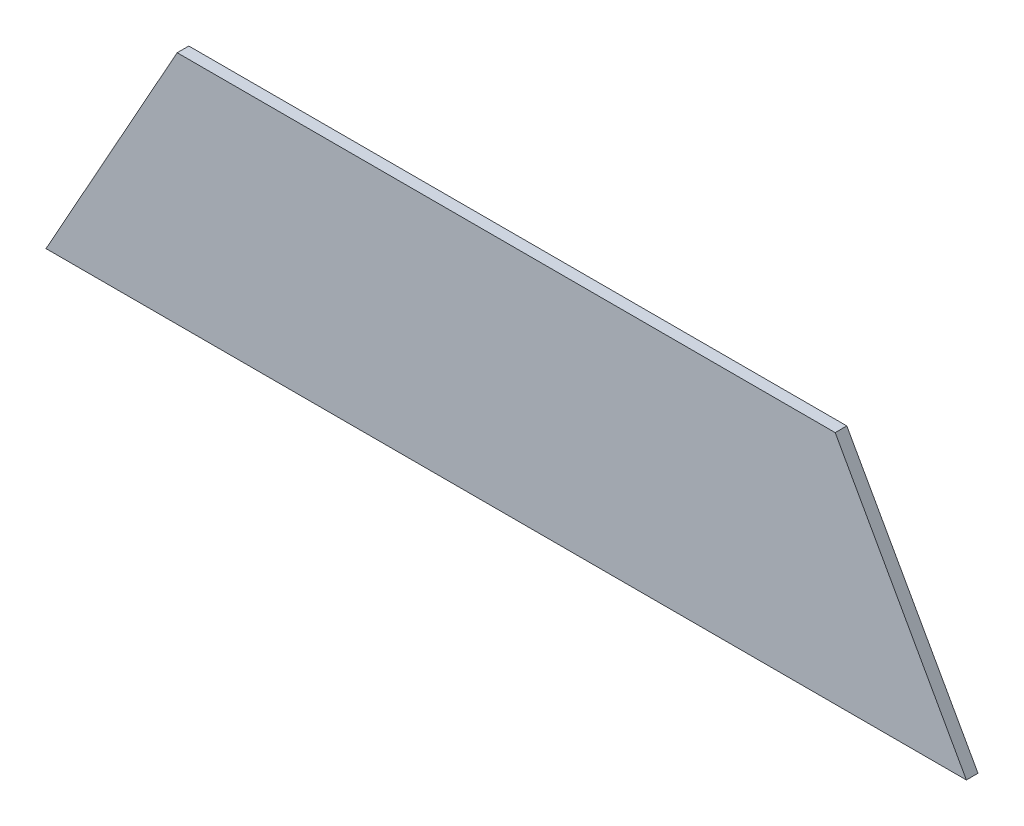
ISO-10303-21;
HEADER;
FILE_DESCRIPTION(('STEP AP214'),'2;1');
FILE_NAME('part.step','',(''),(''),'','','');
FILE_SCHEMA(('AUTOMOTIVE_DESIGN { 1 0 10303 214 1 1 1 1 }'));
ENDSEC;
DATA;
#1=APPLICATION_CONTEXT('core data for automotive mechanical design processes');
#2=APPLICATION_PROTOCOL_DEFINITION('international standard','automotive_design',2000,#1);
#3=PRODUCT_CONTEXT('',#1,'mechanical');
#4=PRODUCT('Part','Part','',(#3));
#5=PRODUCT_RELATED_PRODUCT_CATEGORY('part','',(#4));
#6=PRODUCT_DEFINITION_FORMATION('','',#4);
#7=PRODUCT_DEFINITION_CONTEXT('part definition',#1,'design');
#8=PRODUCT_DEFINITION('design','',#6,#7);
#9=PRODUCT_DEFINITION_SHAPE('','',#8);
#10=(LENGTH_UNIT() NAMED_UNIT(*) SI_UNIT(.MILLI.,.METRE.));
#11=(NAMED_UNIT(*) PLANE_ANGLE_UNIT() SI_UNIT($,.RADIAN.));
#12=(NAMED_UNIT(*) SI_UNIT($,.STERADIAN.) SOLID_ANGLE_UNIT());
#13=UNCERTAINTY_MEASURE_WITH_UNIT(LENGTH_MEASURE(1.E-05),#10,'distance_accuracy_value','');
#14=(GEOMETRIC_REPRESENTATION_CONTEXT(3) GLOBAL_UNCERTAINTY_ASSIGNED_CONTEXT((#13)) GLOBAL_UNIT_ASSIGNED_CONTEXT((#10,
#11,#12)) REPRESENTATION_CONTEXT('',''));
#15=CARTESIAN_POINT('',(0.,0.,0.));
#16=DIRECTION('',(0.,0.,1.));
#17=DIRECTION('',(1.,0.,0.));
#18=AXIS2_PLACEMENT_3D('',#15,#16,#17);
#19=CARTESIAN_POINT('',(0.,-1.38777878078145E-13,-11.9062500000003));
#20=DIRECTION('',(0.,0.,-1.));
#21=DIRECTION('',(0.,1.,0.));
#22=AXIS2_PLACEMENT_3D('',#19,#20,#21);
#23=PLANE('',#22);
#24=DIRECTION('',(1.,0.,0.));
#25=VECTOR('',#24,1.);
#26=CARTESIAN_POINT('',(471.55027255906,-687.093002220171,-11.9062500000005));
#27=LINE('',#26,#25);
#28=CARTESIAN_POINT('',(-471.55027255906,-687.093002220171,-11.9062500000005));
#29=VERTEX_POINT('',#28);
#30=CARTESIAN_POINT('',(471.55027255906,-687.093002220171,-11.9062500000005));
#31=VERTEX_POINT('',#30);
#32=EDGE_CURVE('E36',#29,#31,#27,.T.);
#33=ORIENTED_EDGE('',*,*,#32,.F.);
#34=DIRECTION('',(-0.487058473848149,-0.873369362327711,0.));
#35=VECTOR('',#34,1.);
#36=CARTESIAN_POINT('',(-471.55027255906,-687.093002220171,-11.9062500000005));
#37=LINE('',#36,#35);
#38=CARTESIAN_POINT('',(-337.114930678369,-446.030141974663,-11.9062500000005));
#39=VERTEX_POINT('',#38);
#40=EDGE_CURVE('E60',#39,#29,#37,.T.);
#41=ORIENTED_EDGE('',*,*,#40,.F.);
#42=DIRECTION('',(-1.,0.,0.));
#43=VECTOR('',#42,1.);
#44=CARTESIAN_POINT('',(-337.114930678369,-446.030141974663,-11.9062500000005));
#45=LINE('',#44,#43);
#46=CARTESIAN_POINT('',(337.114930678369,-446.030141974663,-11.9062500000006));
#47=VERTEX_POINT('',#46);
#48=EDGE_CURVE('E80',#47,#39,#45,.T.);
#49=ORIENTED_EDGE('',*,*,#48,.F.);
#50=DIRECTION('',(-0.487058473848149,0.873369362327711,0.));
#51=VECTOR('',#50,1.);
#52=CARTESIAN_POINT('',(337.114930678369,-446.030141974663,-11.9062500000005));
#53=LINE('',#52,#51);
#54=EDGE_CURVE('E65',#31,#47,#53,.T.);
#55=ORIENTED_EDGE('',*,*,#54,.F.);
#56=EDGE_LOOP('',(#33,#41,#49,#55));
#57=FACE_BOUND('',#56,.T.);
#58=ADVANCED_FACE('F28',(#57),#23,.T.);
#59=CARTESIAN_POINT('',(0.,0.,0.));
#60=DIRECTION('',(0.,0.,-1.));
#61=DIRECTION('',(-1.,0.,0.));
#62=AXIS2_PLACEMENT_3D('',#59,#60,#61);
#63=PLANE('',#62);
#64=DIRECTION('',(1.,0.,0.));
#65=VECTOR('',#64,1.);
#66=CARTESIAN_POINT('',(471.55027255906,-687.093002220171,0.));
#67=LINE('',#66,#65);
#68=CARTESIAN_POINT('',(-471.55027255906,-687.093002220171,0.));
#69=VERTEX_POINT('',#68);
#70=CARTESIAN_POINT('',(471.55027255906,-687.093002220171,0.));
#71=VERTEX_POINT('',#70);
#72=EDGE_CURVE('E70',#69,#71,#67,.T.);
#73=ORIENTED_EDGE('',*,*,#72,.T.);
#74=DIRECTION('',(-0.487058473848149,0.873369362327711,0.));
#75=VECTOR('',#74,1.);
#76=CARTESIAN_POINT('',(337.114930678369,-446.030141974663,0.));
#77=LINE('',#76,#75);
#78=CARTESIAN_POINT('',(337.114930678369,-446.030141974663,0.));
#79=VERTEX_POINT('',#78);
#80=EDGE_CURVE('E94',#71,#79,#77,.T.);
#81=ORIENTED_EDGE('',*,*,#80,.T.);
#82=DIRECTION('',(-1.,0.,0.));
#83=VECTOR('',#82,1.);
#84=CARTESIAN_POINT('',(-337.114930678369,-446.030141974663,0.));
#85=LINE('',#84,#83);
#86=CARTESIAN_POINT('',(-337.114930678369,-446.030141974663,0.));
#87=VERTEX_POINT('',#86);
#88=EDGE_CURVE('E90',#79,#87,#85,.T.);
#89=ORIENTED_EDGE('',*,*,#88,.T.);
#90=DIRECTION('',(-0.487058473848149,-0.873369362327711,0.));
#91=VECTOR('',#90,1.);
#92=CARTESIAN_POINT('',(-471.55027255906,-687.093002220171,0.));
#93=LINE('',#92,#91);
#94=EDGE_CURVE('E89',#87,#69,#93,.T.);
#95=ORIENTED_EDGE('',*,*,#94,.T.);
#96=EDGE_LOOP('',(#73,#81,#89,#95));
#97=FACE_BOUND('',#96,.T.);
#98=ADVANCED_FACE('F99',(#97),#63,.F.);
#99=CARTESIAN_POINT('',(337.114930678369,-446.030141974663,-985.32801922023));
#100=DIRECTION('',(0.873369362327711,0.48705847384815,0.));
#101=DIRECTION('',(-0.487058473848149,0.873369362327711,0.));
#102=AXIS2_PLACEMENT_3D('',#99,#100,#101);
#103=PLANE('',#102);
#104=DIRECTION('',(0.,0.,1.));
#105=VECTOR('',#104,1.);
#106=CARTESIAN_POINT('',(471.55027255906,-687.093002220171,-985.32801922023));
#107=LINE('',#106,#105);
#108=EDGE_CURVE('E11',#31,#71,#107,.T.);
#109=ORIENTED_EDGE('',*,*,#108,.F.);
#110=ORIENTED_EDGE('',*,*,#54,.T.);
#111=DIRECTION('',(0.,0.,1.));
#112=VECTOR('',#111,1.);
#113=CARTESIAN_POINT('',(337.114930678369,-446.030141974663,-985.32801922023));
#114=LINE('',#113,#112);
#115=EDGE_CURVE('E84',#47,#79,#114,.T.);
#116=ORIENTED_EDGE('',*,*,#115,.T.);
#117=ORIENTED_EDGE('',*,*,#80,.F.);
#118=EDGE_LOOP('',(#109,#110,#116,#117));
#119=FACE_BOUND('',#118,.T.);
#120=ADVANCED_FACE('F103',(#119),#103,.T.);
#121=CARTESIAN_POINT('',(-337.114930678369,-446.030141974663,-985.32801922023));
#122=DIRECTION('',(0.,1.,0.));
#123=DIRECTION('',(-1.,0.,0.));
#124=AXIS2_PLACEMENT_3D('',#121,#122,#123);
#125=PLANE('',#124);
#126=ORIENTED_EDGE('',*,*,#115,.F.);
#127=ORIENTED_EDGE('',*,*,#48,.T.);
#128=DIRECTION('',(0.,0.,1.));
#129=VECTOR('',#128,1.);
#130=CARTESIAN_POINT('',(-337.114930678369,-446.030141974663,-985.32801922023));
#131=LINE('',#130,#129);
#132=EDGE_CURVE('E77',#39,#87,#131,.T.);
#133=ORIENTED_EDGE('',*,*,#132,.T.);
#134=ORIENTED_EDGE('',*,*,#88,.F.);
#135=EDGE_LOOP('',(#126,#127,#133,#134));
#136=FACE_BOUND('',#135,.T.);
#137=ADVANCED_FACE('F101',(#136),#125,.T.);
#138=CARTESIAN_POINT('',(-471.55027255906,-687.093002220171,-985.32801922023));
#139=DIRECTION('',(-0.87336936232771,0.48705847384815,0.));
#140=DIRECTION('',(-0.487058473848149,-0.873369362327711,0.));
#141=AXIS2_PLACEMENT_3D('',#138,#139,#140);
#142=PLANE('',#141);
#143=ORIENTED_EDGE('',*,*,#132,.F.);
#144=ORIENTED_EDGE('',*,*,#40,.T.);
#145=DIRECTION('',(0.,0.,1.));
#146=VECTOR('',#145,1.);
#147=CARTESIAN_POINT('',(-471.55027255906,-687.093002220171,-985.32801922023));
#148=LINE('',#147,#146);
#149=EDGE_CURVE('E66',#29,#69,#148,.T.);
#150=ORIENTED_EDGE('',*,*,#149,.T.);
#151=ORIENTED_EDGE('',*,*,#94,.F.);
#152=EDGE_LOOP('',(#143,#144,#150,#151));
#153=FACE_BOUND('',#152,.T.);
#154=ADVANCED_FACE('F75',(#153),#142,.T.);
#155=CARTESIAN_POINT('',(471.55027255906,-687.093002220171,-985.32801922023));
#156=DIRECTION('',(0.,-1.,0.));
#157=DIRECTION('',(1.,0.,0.));
#158=AXIS2_PLACEMENT_3D('',#155,#156,#157);
#159=PLANE('',#158);
#160=ORIENTED_EDGE('',*,*,#149,.F.);
#161=ORIENTED_EDGE('',*,*,#32,.T.);
#162=ORIENTED_EDGE('',*,*,#108,.T.);
#163=ORIENTED_EDGE('',*,*,#72,.F.);
#164=EDGE_LOOP('',(#160,#161,#162,#163));
#165=FACE_BOUND('',#164,.T.);
#166=ADVANCED_FACE('F68',(#165),#159,.T.);
#167=CLOSED_SHELL('',(#58,#98,#120,#137,#154,#166));
#168=MANIFOLD_SOLID_BREP('B2',#167);
#169=ADVANCED_BREP_SHAPE_REPRESENTATION('',(#18,#168),#14);
#170=SHAPE_DEFINITION_REPRESENTATION(#9,#169);
ENDSEC;
END-ISO-10303-21;
